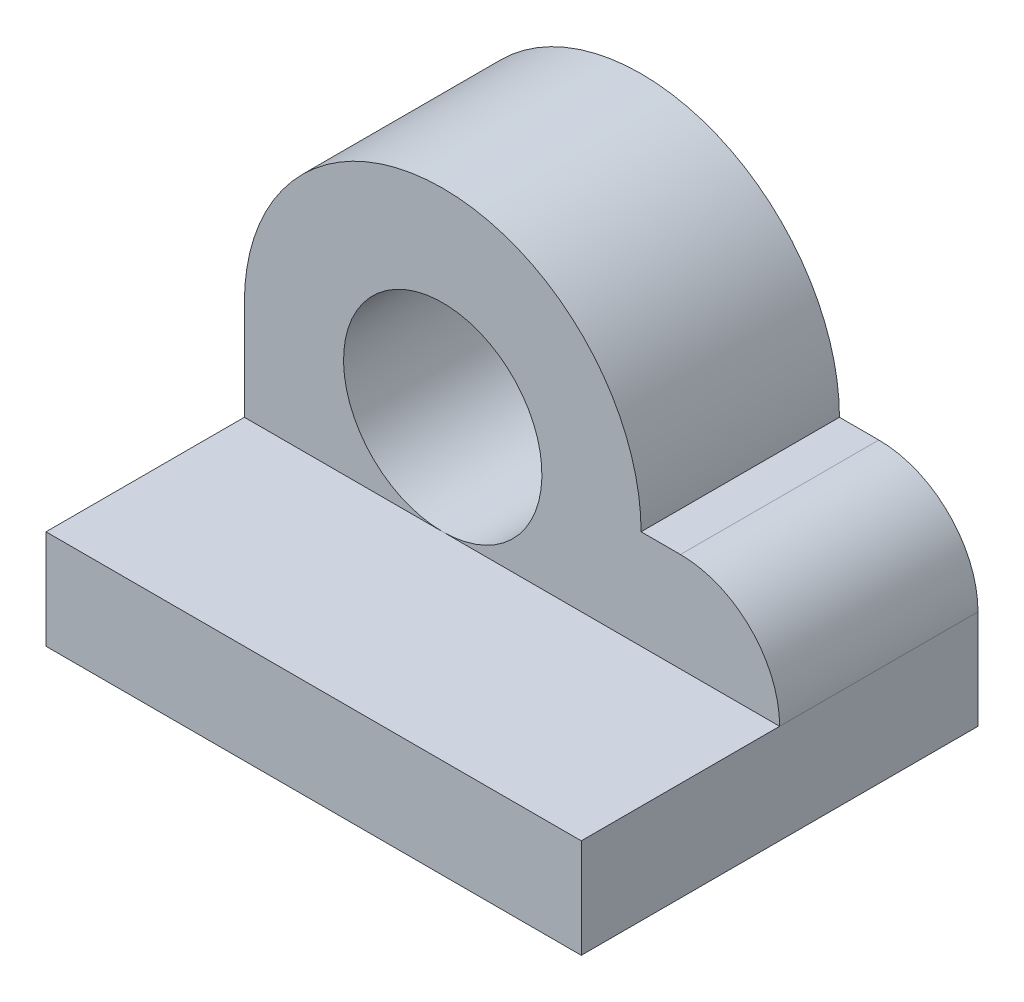
ISO-10303-21;
HEADER;
FILE_DESCRIPTION(('STEP AP214'),'2;1');
FILE_NAME('part.step','',(''),(''),'','','');
FILE_SCHEMA(('AUTOMOTIVE_DESIGN { 1 0 10303 214 1 1 1 1 }'));
ENDSEC;
DATA;
#1=APPLICATION_CONTEXT('core data for automotive mechanical design processes');
#2=APPLICATION_PROTOCOL_DEFINITION('international standard','automotive_design',2000,#1);
#3=PRODUCT_CONTEXT('',#1,'mechanical');
#4=PRODUCT('Part','Part','',(#3));
#5=PRODUCT_RELATED_PRODUCT_CATEGORY('part','',(#4));
#6=PRODUCT_DEFINITION_FORMATION('','',#4);
#7=PRODUCT_DEFINITION_CONTEXT('part definition',#1,'design');
#8=PRODUCT_DEFINITION('design','',#6,#7);
#9=PRODUCT_DEFINITION_SHAPE('','',#8);
#10=(LENGTH_UNIT() NAMED_UNIT(*) SI_UNIT(.MILLI.,.METRE.));
#11=(NAMED_UNIT(*) PLANE_ANGLE_UNIT() SI_UNIT($,.RADIAN.));
#12=(NAMED_UNIT(*) SI_UNIT($,.STERADIAN.) SOLID_ANGLE_UNIT());
#13=UNCERTAINTY_MEASURE_WITH_UNIT(LENGTH_MEASURE(1.E-05),#10,'distance_accuracy_value','');
#14=(GEOMETRIC_REPRESENTATION_CONTEXT(3) GLOBAL_UNCERTAINTY_ASSIGNED_CONTEXT((#13)) GLOBAL_UNIT_ASSIGNED_CONTEXT((#10,
#11,#12)) REPRESENTATION_CONTEXT('',''));
#15=CARTESIAN_POINT('',(0.,0.,0.));
#16=DIRECTION('',(0.,0.,1.));
#17=DIRECTION('',(1.,0.,0.));
#18=AXIS2_PLACEMENT_3D('',#15,#16,#17);
#19=CARTESIAN_POINT('',(0.,0.,508.));
#20=DIRECTION('',(-1.,0.,0.));
#21=DIRECTION('',(0.,0.,1.));
#22=AXIS2_PLACEMENT_3D('',#19,#20,#21);
#23=PLANE('',#22);
#24=DIRECTION('',(0.,0.,-1.));
#25=VECTOR('',#24,1.);
#26=CARTESIAN_POINT('',(0.,508.,508.));
#27=LINE('',#26,#25);
#28=CARTESIAN_POINT('',(0.,508.,508.));
#29=VERTEX_POINT('',#28);
#30=CARTESIAN_POINT('',(0.,508.,0.));
#31=VERTEX_POINT('',#30);
#32=EDGE_CURVE('E138',#29,#31,#27,.T.);
#33=ORIENTED_EDGE('',*,*,#32,.T.);
#34=DIRECTION('',(0.,1.,0.));
#35=VECTOR('',#34,1.);
#36=CARTESIAN_POINT('',(0.,0.,0.));
#37=LINE('',#36,#35);
#38=CARTESIAN_POINT('',(0.,0.,0.));
#39=VERTEX_POINT('',#38);
#40=EDGE_CURVE('E142',#39,#31,#37,.T.);
#41=ORIENTED_EDGE('',*,*,#40,.F.);
#42=DIRECTION('',(0.,0.,-1.));
#43=VECTOR('',#42,1.);
#44=CARTESIAN_POINT('',(0.,0.,508.));
#45=LINE('',#44,#43);
#46=CARTESIAN_POINT('',(0.,0.,1016.));
#47=VERTEX_POINT('',#46);
#48=EDGE_CURVE('E11',#47,#39,#45,.T.);
#49=ORIENTED_EDGE('',*,*,#48,.F.);
#50=DIRECTION('',(0.,1.,0.));
#51=VECTOR('',#50,1.);
#52=CARTESIAN_POINT('',(0.,0.,1016.));
#53=LINE('',#52,#51);
#54=CARTESIAN_POINT('',(0.,254.,1016.));
#55=VERTEX_POINT('',#54);
#56=EDGE_CURVE('E110',#47,#55,#53,.T.);
#57=ORIENTED_EDGE('',*,*,#56,.T.);
#58=DIRECTION('',(0.,0.,-1.));
#59=VECTOR('',#58,1.);
#60=CARTESIAN_POINT('',(0.,254.,1016.));
#61=LINE('',#60,#59);
#62=CARTESIAN_POINT('',(0.,254.,508.));
#63=VERTEX_POINT('',#62);
#64=EDGE_CURVE('E96',#55,#63,#61,.T.);
#65=ORIENTED_EDGE('',*,*,#64,.T.);
#66=DIRECTION('',(0.,1.,0.));
#67=VECTOR('',#66,1.);
#68=CARTESIAN_POINT('',(0.,0.,508.));
#69=LINE('',#68,#67);
#70=EDGE_CURVE('E48',#63,#29,#69,.T.);
#71=ORIENTED_EDGE('',*,*,#70,.T.);
#72=EDGE_LOOP('',(#33,#41,#49,#57,#65,#71));
#73=FACE_BOUND('',#72,.T.);
#74=ADVANCED_FACE('F33',(#73),#23,.T.);
#75=CARTESIAN_POINT('',(0.,0.,508.));
#76=DIRECTION('',(0.,1.,0.));
#77=DIRECTION('',(0.,0.,1.));
#78=AXIS2_PLACEMENT_3D('',#75,#76,#77);
#79=PLANE('',#78);
#80=DIRECTION('',(1.,0.,0.));
#81=VECTOR('',#80,1.);
#82=CARTESIAN_POINT('',(0.,0.,0.));
#83=LINE('',#82,#81);
#84=CARTESIAN_POINT('',(1370.79251200113,0.,0.));
#85=VERTEX_POINT('',#84);
#86=EDGE_CURVE('E144',#39,#85,#83,.T.);
#87=ORIENTED_EDGE('',*,*,#86,.T.);
#88=DIRECTION('',(0.,0.,-1.));
#89=VECTOR('',#88,1.);
#90=CARTESIAN_POINT('',(1370.79251200113,0.,508.));
#91=LINE('',#90,#89);
#92=CARTESIAN_POINT('',(1370.79251200113,0.,1016.));
#93=VERTEX_POINT('',#92);
#94=EDGE_CURVE('E41',#93,#85,#91,.T.);
#95=ORIENTED_EDGE('',*,*,#94,.F.);
#96=DIRECTION('',(1.,0.,0.));
#97=VECTOR('',#96,1.);
#98=CARTESIAN_POINT('',(0.,0.,1016.));
#99=LINE('',#98,#97);
#100=EDGE_CURVE('E118',#47,#93,#99,.T.);
#101=ORIENTED_EDGE('',*,*,#100,.F.);
#102=ORIENTED_EDGE('',*,*,#48,.T.);
#103=EDGE_LOOP('',(#87,#95,#101,#102));
#104=FACE_BOUND('',#103,.T.);
#105=ADVANCED_FACE('F172',(#104),#79,.F.);
#106=CARTESIAN_POINT('',(1370.79251200113,0.,508.));
#107=DIRECTION('',(-1.,0.,0.));
#108=DIRECTION('',(0.,0.,1.));
#109=AXIS2_PLACEMENT_3D('',#106,#107,#108);
#110=PLANE('',#109);
#111=DIRECTION('',(0.,1.,0.));
#112=VECTOR('',#111,1.);
#113=CARTESIAN_POINT('',(1370.79251200113,0.,0.));
#114=LINE('',#113,#112);
#115=CARTESIAN_POINT('',(1370.79251200113,254.,0.));
#116=VERTEX_POINT('',#115);
#117=EDGE_CURVE('E147',#85,#116,#114,.T.);
#118=ORIENTED_EDGE('',*,*,#117,.T.);
#119=DIRECTION('',(0.,0.,-1.));
#120=VECTOR('',#119,1.);
#121=CARTESIAN_POINT('',(1370.79251200113,254.,508.));
#122=LINE('',#121,#120);
#123=CARTESIAN_POINT('',(1370.79251200113,254.,508.));
#124=VERTEX_POINT('',#123);
#125=EDGE_CURVE('E165',#124,#116,#122,.T.);
#126=ORIENTED_EDGE('',*,*,#125,.F.);
#127=DIRECTION('',(0.,0.,-1.));
#128=VECTOR('',#127,1.);
#129=CARTESIAN_POINT('',(1370.79251200113,254.,1016.));
#130=LINE('',#129,#128);
#131=CARTESIAN_POINT('',(1370.79251200113,254.,1016.));
#132=VERTEX_POINT('',#131);
#133=EDGE_CURVE('E104',#132,#124,#130,.T.);
#134=ORIENTED_EDGE('',*,*,#133,.F.);
#135=DIRECTION('',(0.,1.,0.));
#136=VECTOR('',#135,1.);
#137=CARTESIAN_POINT('',(1370.79251200113,0.,1016.));
#138=LINE('',#137,#136);
#139=EDGE_CURVE('E112',#93,#132,#138,.T.);
#140=ORIENTED_EDGE('',*,*,#139,.F.);
#141=ORIENTED_EDGE('',*,*,#94,.T.);
#142=EDGE_LOOP('',(#118,#126,#134,#140,#141));
#143=FACE_BOUND('',#142,.T.);
#144=ADVANCED_FACE('F169',(#143),#110,.F.);
#145=CARTESIAN_POINT('',(1116.79251200113,254.,508.));
#146=DIRECTION('',(0.,0.,-1.));
#147=DIRECTION('',(-1.,0.,0.));
#148=AXIS2_PLACEMENT_3D('',#145,#146,#147);
#149=CYLINDRICAL_SURFACE('',#148,254.);
#150=CARTESIAN_POINT('',(1116.79251200113,254.,0.));
#151=DIRECTION('',(0.,0.,1.));
#152=DIRECTION('',(1.,0.,0.));
#153=AXIS2_PLACEMENT_3D('',#150,#151,#152);
#154=CIRCLE('',#153,254.);
#155=CARTESIAN_POINT('',(1116.79251200113,508.,0.));
#156=VERTEX_POINT('',#155);
#157=EDGE_CURVE('E150',#116,#156,#154,.T.);
#158=ORIENTED_EDGE('',*,*,#157,.T.);
#159=DIRECTION('',(0.,0.,-1.));
#160=VECTOR('',#159,1.);
#161=CARTESIAN_POINT('',(1116.79251200113,508.,508.));
#162=LINE('',#161,#160);
#163=CARTESIAN_POINT('',(1116.79251200113,508.,508.));
#164=VERTEX_POINT('',#163);
#165=EDGE_CURVE('E162',#164,#156,#162,.T.);
#166=ORIENTED_EDGE('',*,*,#165,.F.);
#167=CARTESIAN_POINT('',(1116.79251200113,254.,508.));
#168=DIRECTION('',(0.,0.,1.));
#169=DIRECTION('',(1.,0.,0.));
#170=AXIS2_PLACEMENT_3D('',#167,#168,#169);
#171=CIRCLE('',#170,254.);
#172=EDGE_CURVE('E130',#124,#164,#171,.T.);
#173=ORIENTED_EDGE('',*,*,#172,.F.);
#174=ORIENTED_EDGE('',*,*,#125,.T.);
#175=EDGE_LOOP('',(#158,#166,#173,#174));
#176=FACE_BOUND('',#175,.T.);
#177=ADVANCED_FACE('F184',(#176),#149,.T.);
#178=CARTESIAN_POINT('',(5.59558726449122E-13,508.000000000001,508.));
#179=DIRECTION('',(0.,-1.,0.));
#180=DIRECTION('',(1.,0.,0.));
#181=AXIS2_PLACEMENT_3D('',#178,#179,#180);
#182=PLANE('',#181);
#183=DIRECTION('',(-1.,0.,0.));
#184=VECTOR('',#183,1.);
#185=CARTESIAN_POINT('',(5.59558726449122E-13,508.000000000001,0.));
#186=LINE('',#185,#184);
#187=CARTESIAN_POINT('',(1016.,508.,0.));
#188=VERTEX_POINT('',#187);
#189=EDGE_CURVE('E153',#156,#188,#186,.T.);
#190=ORIENTED_EDGE('',*,*,#189,.T.);
#191=DIRECTION('',(0.,0.,-1.));
#192=VECTOR('',#191,1.);
#193=CARTESIAN_POINT('',(1016.,508.,508.));
#194=LINE('',#193,#192);
#195=CARTESIAN_POINT('',(1016.,508.,508.));
#196=VERTEX_POINT('',#195);
#197=EDGE_CURVE('E159',#196,#188,#194,.T.);
#198=ORIENTED_EDGE('',*,*,#197,.F.);
#199=DIRECTION('',(-1.,0.,0.));
#200=VECTOR('',#199,1.);
#201=CARTESIAN_POINT('',(5.59558726449122E-13,508.000000000001,508.));
#202=LINE('',#201,#200);
#203=EDGE_CURVE('E133',#164,#196,#202,.T.);
#204=ORIENTED_EDGE('',*,*,#203,.F.);
#205=ORIENTED_EDGE('',*,*,#165,.T.);
#206=EDGE_LOOP('',(#190,#198,#204,#205));
#207=FACE_BOUND('',#206,.T.);
#208=ADVANCED_FACE('F181',(#207),#182,.F.);
#209=CARTESIAN_POINT('',(508.,508.,508.));
#210=DIRECTION('',(0.,0.,-1.));
#211=DIRECTION('',(-1.,0.,0.));
#212=AXIS2_PLACEMENT_3D('',#209,#210,#211);
#213=CYLINDRICAL_SURFACE('',#212,254.);
#214=CARTESIAN_POINT('',(508.,508.,0.));
#215=DIRECTION('',(0.,0.,1.));
#216=DIRECTION('',(1.,0.,0.));
#217=AXIS2_PLACEMENT_3D('',#214,#215,#216);
#218=CIRCLE('',#217,254.);
#219=CARTESIAN_POINT('',(762.,508.,0.));
#220=VERTEX_POINT('',#219);
#221=EDGE_CURVE('E139',#220,#220,#218,.T.);
#222=ORIENTED_EDGE('',*,*,#221,.F.);
#223=EDGE_LOOP('',(#222));
#224=FACE_BOUND('',#223,.T.);
#225=CARTESIAN_POINT('',(508.,508.,508.));
#226=DIRECTION('',(0.,0.,1.));
#227=DIRECTION('',(1.,0.,0.));
#228=AXIS2_PLACEMENT_3D('',#225,#226,#227);
#229=CIRCLE('',#228,254.);
#230=CARTESIAN_POINT('',(508.,254.,508.));
#231=VERTEX_POINT('',#230);
#232=EDGE_CURVE('E126',#231,#231,#229,.T.);
#233=ORIENTED_EDGE('',*,*,#232,.T.);
#234=EDGE_LOOP('',(#233));
#235=FACE_BOUND('',#234,.T.);
#236=ADVANCED_FACE('F35',(#224,#235),#213,.F.);
#237=CARTESIAN_POINT('',(508.,508.,508.));
#238=DIRECTION('',(0.,0.,-1.));
#239=DIRECTION('',(-1.,0.,0.));
#240=AXIS2_PLACEMENT_3D('',#237,#238,#239);
#241=CYLINDRICAL_SURFACE('',#240,508.);
#242=CARTESIAN_POINT('',(508.,508.,0.));
#243=DIRECTION('',(0.,0.,1.));
#244=DIRECTION('',(1.,0.,0.));
#245=AXIS2_PLACEMENT_3D('',#242,#243,#244);
#246=CIRCLE('',#245,508.);
#247=EDGE_CURVE('E128',#188,#31,#246,.T.);
#248=ORIENTED_EDGE('',*,*,#247,.T.);
#249=ORIENTED_EDGE('',*,*,#32,.F.);
#250=CARTESIAN_POINT('',(508.,508.,508.));
#251=DIRECTION('',(0.,0.,1.));
#252=DIRECTION('',(1.,0.,0.));
#253=AXIS2_PLACEMENT_3D('',#250,#251,#252);
#254=CIRCLE('',#253,508.);
#255=EDGE_CURVE('E136',#196,#29,#254,.T.);
#256=ORIENTED_EDGE('',*,*,#255,.F.);
#257=ORIENTED_EDGE('',*,*,#197,.T.);
#258=EDGE_LOOP('',(#248,#249,#256,#257));
#259=FACE_BOUND('',#258,.T.);
#260=ADVANCED_FACE('F177',(#259),#241,.T.);
#261=CARTESIAN_POINT('',(0.,0.,508.));
#262=DIRECTION('',(0.,0.,1.));
#263=DIRECTION('',(1.,0.,0.));
#264=AXIS2_PLACEMENT_3D('',#261,#262,#263);
#265=PLANE('',#264);
#266=DIRECTION('',(-1.,0.,0.));
#267=VECTOR('',#266,1.);
#268=CARTESIAN_POINT('',(0.,254.,508.));
#269=LINE('',#268,#267);
#270=EDGE_CURVE('E125',#124,#231,#269,.T.);
#271=ORIENTED_EDGE('',*,*,#270,.F.);
#272=ORIENTED_EDGE('',*,*,#172,.T.);
#273=ORIENTED_EDGE('',*,*,#203,.T.);
#274=ORIENTED_EDGE('',*,*,#255,.T.);
#275=ORIENTED_EDGE('',*,*,#70,.F.);
#276=EDGE_CURVE('E52',#231,#63,#269,.T.);
#277=ORIENTED_EDGE('',*,*,#276,.F.);
#278=ORIENTED_EDGE('',*,*,#232,.F.);
#279=EDGE_LOOP('',(#271,#272,#273,#274,#275,#277,#278));
#280=FACE_BOUND('',#279,.T.);
#281=ADVANCED_FACE('F186',(#280),#265,.T.);
#282=CARTESIAN_POINT('',(0.,0.,0.));
#283=DIRECTION('',(0.,0.,1.));
#284=DIRECTION('',(1.,0.,0.));
#285=AXIS2_PLACEMENT_3D('',#282,#283,#284);
#286=PLANE('',#285);
#287=ORIENTED_EDGE('',*,*,#221,.T.);
#288=EDGE_LOOP('',(#287));
#289=FACE_BOUND('',#288,.T.);
#290=ORIENTED_EDGE('',*,*,#157,.F.);
#291=ORIENTED_EDGE('',*,*,#117,.F.);
#292=ORIENTED_EDGE('',*,*,#86,.F.);
#293=ORIENTED_EDGE('',*,*,#40,.T.);
#294=ORIENTED_EDGE('',*,*,#247,.F.);
#295=ORIENTED_EDGE('',*,*,#189,.F.);
#296=EDGE_LOOP('',(#290,#291,#292,#293,#294,#295));
#297=FACE_BOUND('',#296,.T.);
#298=ADVANCED_FACE('F174',(#289,#297),#286,.F.);
#299=CARTESIAN_POINT('',(0.,254.,1016.));
#300=DIRECTION('',(0.,1.,0.));
#301=DIRECTION('',(0.,0.,1.));
#302=AXIS2_PLACEMENT_3D('',#299,#300,#301);
#303=PLANE('',#302);
#304=ORIENTED_EDGE('',*,*,#133,.T.);
#305=ORIENTED_EDGE('',*,*,#270,.T.);
#306=ORIENTED_EDGE('',*,*,#276,.T.);
#307=ORIENTED_EDGE('',*,*,#64,.F.);
#308=DIRECTION('',(1.,0.,0.));
#309=VECTOR('',#308,1.);
#310=CARTESIAN_POINT('',(0.,254.,1016.));
#311=LINE('',#310,#309);
#312=EDGE_CURVE('E100',#55,#132,#311,.T.);
#313=ORIENTED_EDGE('',*,*,#312,.T.);
#314=EDGE_LOOP('',(#304,#305,#306,#307,#313));
#315=FACE_BOUND('',#314,.T.);
#316=ADVANCED_FACE('F99',(#315),#303,.T.);
#317=CARTESIAN_POINT('',(0.,0.,1016.));
#318=DIRECTION('',(0.,0.,1.));
#319=DIRECTION('',(1.,0.,0.));
#320=AXIS2_PLACEMENT_3D('',#317,#318,#319);
#321=PLANE('',#320);
#322=ORIENTED_EDGE('',*,*,#312,.F.);
#323=ORIENTED_EDGE('',*,*,#56,.F.);
#324=ORIENTED_EDGE('',*,*,#100,.T.);
#325=ORIENTED_EDGE('',*,*,#139,.T.);
#326=EDGE_LOOP('',(#322,#323,#324,#325));
#327=FACE_BOUND('',#326,.T.);
#328=ADVANCED_FACE('F108',(#327),#321,.T.);
#329=CLOSED_SHELL('',(#74,#105,#144,#177,#208,#236,#260,#281,#298,#316,#328));
#330=MANIFOLD_SOLID_BREP('B2',#329);
#331=ADVANCED_BREP_SHAPE_REPRESENTATION('',(#18,#330),#14);
#332=SHAPE_DEFINITION_REPRESENTATION(#9,#331);
ENDSEC;
END-ISO-10303-21;
